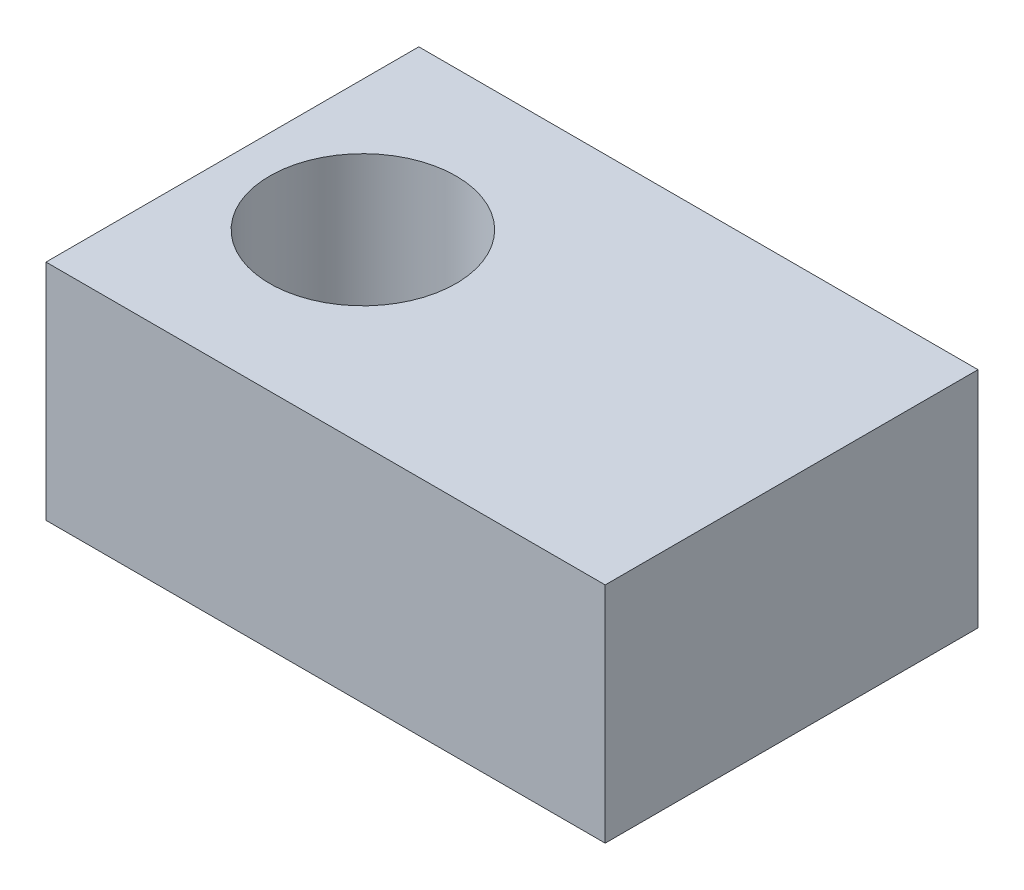
ISO-10303-21;
HEADER;
FILE_DESCRIPTION(('STEP AP214'),'2;1');
FILE_NAME('part.step','',(''),(''),'','','');
FILE_SCHEMA(('AUTOMOTIVE_DESIGN { 1 0 10303 214 1 1 1 1 }'));
ENDSEC;
DATA;
#1=APPLICATION_CONTEXT('core data for automotive mechanical design processes');
#2=APPLICATION_PROTOCOL_DEFINITION('international standard','automotive_design',2000,#1);
#3=PRODUCT_CONTEXT('',#1,'mechanical');
#4=PRODUCT('Part','Part','',(#3));
#5=PRODUCT_RELATED_PRODUCT_CATEGORY('part','',(#4));
#6=PRODUCT_DEFINITION_FORMATION('','',#4);
#7=PRODUCT_DEFINITION_CONTEXT('part definition',#1,'design');
#8=PRODUCT_DEFINITION('design','',#6,#7);
#9=PRODUCT_DEFINITION_SHAPE('','',#8);
#10=(LENGTH_UNIT() NAMED_UNIT(*) SI_UNIT(.MILLI.,.METRE.));
#11=(NAMED_UNIT(*) PLANE_ANGLE_UNIT() SI_UNIT($,.RADIAN.));
#12=(NAMED_UNIT(*) SI_UNIT($,.STERADIAN.) SOLID_ANGLE_UNIT());
#13=UNCERTAINTY_MEASURE_WITH_UNIT(LENGTH_MEASURE(1.E-05),#10,'distance_accuracy_value','');
#14=(GEOMETRIC_REPRESENTATION_CONTEXT(3) GLOBAL_UNCERTAINTY_ASSIGNED_CONTEXT((#13)) GLOBAL_UNIT_ASSIGNED_CONTEXT((#10,
#11,#12)) REPRESENTATION_CONTEXT('',''));
#15=CARTESIAN_POINT('',(0.,0.,0.));
#16=DIRECTION('',(0.,0.,1.));
#17=DIRECTION('',(1.,0.,0.));
#18=AXIS2_PLACEMENT_3D('',#15,#16,#17);
#19=CARTESIAN_POINT('',(0.,0.,0.));
#20=DIRECTION('',(0.,-1.,0.));
#21=DIRECTION('',(0.,0.,-1.));
#22=AXIS2_PLACEMENT_3D('',#19,#20,#21);
#23=PLANE('',#22);
#24=CARTESIAN_POINT('',(3.5,0.,-5.));
#25=DIRECTION('',(0.,-1.,0.));
#26=DIRECTION('',(0.,0.,-1.));
#27=AXIS2_PLACEMENT_3D('',#24,#25,#26);
#28=CIRCLE('',#27,2.5);
#29=CARTESIAN_POINT('',(3.5,0.,-7.5));
#30=VERTEX_POINT('',#29);
#31=EDGE_CURVE('E20',#30,#30,#28,.F.);
#32=ORIENTED_EDGE('',*,*,#31,.T.);
#33=EDGE_LOOP('',(#32));
#34=FACE_BOUND('',#33,.T.);
#35=DIRECTION('',(0.,0.,1.));
#36=VECTOR('',#35,1.);
#37=CARTESIAN_POINT('',(15.,0.,0.));
#38=LINE('',#37,#36);
#39=CARTESIAN_POINT('',(15.,0.,-10.));
#40=VERTEX_POINT('',#39);
#41=CARTESIAN_POINT('',(15.,0.,0.));
#42=VERTEX_POINT('',#41);
#43=EDGE_CURVE('E55',#40,#42,#38,.T.);
#44=ORIENTED_EDGE('',*,*,#43,.T.);
#45=DIRECTION('',(-1.,0.,0.));
#46=VECTOR('',#45,1.);
#47=CARTESIAN_POINT('',(0.,0.,0.));
#48=LINE('',#47,#46);
#49=CARTESIAN_POINT('',(0.,0.,0.));
#50=VERTEX_POINT('',#49);
#51=EDGE_CURVE('E79',#42,#50,#48,.T.);
#52=ORIENTED_EDGE('',*,*,#51,.T.);
#53=DIRECTION('',(0.,0.,-1.));
#54=VECTOR('',#53,1.);
#55=CARTESIAN_POINT('',(0.,0.,0.));
#56=LINE('',#55,#54);
#57=CARTESIAN_POINT('',(0.,0.,-10.));
#58=VERTEX_POINT('',#57);
#59=EDGE_CURVE('E59',#50,#58,#56,.T.);
#60=ORIENTED_EDGE('',*,*,#59,.T.);
#61=DIRECTION('',(1.,0.,0.));
#62=VECTOR('',#61,1.);
#63=CARTESIAN_POINT('',(0.,0.,-10.));
#64=LINE('',#63,#62);
#65=EDGE_CURVE('E58',#58,#40,#64,.T.);
#66=ORIENTED_EDGE('',*,*,#65,.T.);
#67=EDGE_LOOP('',(#44,#52,#60,#66));
#68=FACE_BOUND('',#67,.T.);
#69=ADVANCED_FACE('F17',(#34,#68),#23,.T.);
#70=CARTESIAN_POINT('',(0.,6.,-10.));
#71=DIRECTION('',(0.,0.,1.));
#72=DIRECTION('',(1.,0.,0.));
#73=AXIS2_PLACEMENT_3D('',#70,#71,#72);
#74=PLANE('',#73);
#75=DIRECTION('',(0.,1.,0.));
#76=VECTOR('',#75,1.);
#77=CARTESIAN_POINT('',(0.,6.,-10.));
#78=LINE('',#77,#76);
#79=CARTESIAN_POINT('',(0.,6.,-10.));
#80=VERTEX_POINT('',#79);
#81=EDGE_CURVE('E81',#58,#80,#78,.T.);
#82=ORIENTED_EDGE('',*,*,#81,.T.);
#83=DIRECTION('',(1.,0.,0.));
#84=VECTOR('',#83,1.);
#85=CARTESIAN_POINT('',(0.,6.,-10.));
#86=LINE('',#85,#84);
#87=CARTESIAN_POINT('',(15.,6.,-10.));
#88=VERTEX_POINT('',#87);
#89=EDGE_CURVE('E75',#80,#88,#86,.T.);
#90=ORIENTED_EDGE('',*,*,#89,.T.);
#91=DIRECTION('',(0.,1.,0.));
#92=VECTOR('',#91,1.);
#93=CARTESIAN_POINT('',(15.,6.,-10.));
#94=LINE('',#93,#92);
#95=EDGE_CURVE('E64',#88,#40,#94,.F.);
#96=ORIENTED_EDGE('',*,*,#95,.T.);
#97=ORIENTED_EDGE('',*,*,#65,.F.);
#98=EDGE_LOOP('',(#82,#90,#96,#97));
#99=FACE_BOUND('',#98,.T.);
#100=ADVANCED_FACE('F74',(#99),#74,.F.);
#101=CARTESIAN_POINT('',(15.,6.,0.));
#102=DIRECTION('',(-1.,0.,0.));
#103=DIRECTION('',(0.,0.,1.));
#104=AXIS2_PLACEMENT_3D('',#101,#102,#103);
#105=PLANE('',#104);
#106=ORIENTED_EDGE('',*,*,#95,.F.);
#107=DIRECTION('',(0.,0.,-1.));
#108=VECTOR('',#107,1.);
#109=CARTESIAN_POINT('',(15.,6.,0.));
#110=LINE('',#109,#108);
#111=CARTESIAN_POINT('',(15.,6.,0.));
#112=VERTEX_POINT('',#111);
#113=EDGE_CURVE('E86',#88,#112,#110,.F.);
#114=ORIENTED_EDGE('',*,*,#113,.T.);
#115=DIRECTION('',(0.,1.,0.));
#116=VECTOR('',#115,1.);
#117=CARTESIAN_POINT('',(15.,6.,0.));
#118=LINE('',#117,#116);
#119=EDGE_CURVE('E71',#112,#42,#118,.F.);
#120=ORIENTED_EDGE('',*,*,#119,.T.);
#121=ORIENTED_EDGE('',*,*,#43,.F.);
#122=EDGE_LOOP('',(#106,#114,#120,#121));
#123=FACE_BOUND('',#122,.T.);
#124=ADVANCED_FACE('F68',(#123),#105,.F.);
#125=CARTESIAN_POINT('',(0.,6.,0.));
#126=DIRECTION('',(0.,0.,-1.));
#127=DIRECTION('',(-1.,0.,0.));
#128=AXIS2_PLACEMENT_3D('',#125,#126,#127);
#129=PLANE('',#128);
#130=ORIENTED_EDGE('',*,*,#119,.F.);
#131=DIRECTION('',(1.,0.,0.));
#132=VECTOR('',#131,1.);
#133=CARTESIAN_POINT('',(0.,6.,0.));
#134=LINE('',#133,#132);
#135=CARTESIAN_POINT('',(0.,6.,0.));
#136=VERTEX_POINT('',#135);
#137=EDGE_CURVE('E88',#112,#136,#134,.F.);
#138=ORIENTED_EDGE('',*,*,#137,.T.);
#139=DIRECTION('',(0.,1.,0.));
#140=VECTOR('',#139,1.);
#141=CARTESIAN_POINT('',(0.,6.,0.));
#142=LINE('',#141,#140);
#143=EDGE_CURVE('E34',#136,#50,#142,.F.);
#144=ORIENTED_EDGE('',*,*,#143,.T.);
#145=ORIENTED_EDGE('',*,*,#51,.F.);
#146=EDGE_LOOP('',(#130,#138,#144,#145));
#147=FACE_BOUND('',#146,.T.);
#148=ADVANCED_FACE('F96',(#147),#129,.F.);
#149=CARTESIAN_POINT('',(0.,6.,0.));
#150=DIRECTION('',(1.,0.,0.));
#151=DIRECTION('',(0.,0.,-1.));
#152=AXIS2_PLACEMENT_3D('',#149,#150,#151);
#153=PLANE('',#152);
#154=ORIENTED_EDGE('',*,*,#143,.F.);
#155=DIRECTION('',(0.,0.,-1.));
#156=VECTOR('',#155,1.);
#157=CARTESIAN_POINT('',(0.,6.,0.));
#158=LINE('',#157,#156);
#159=EDGE_CURVE('E26',#136,#80,#158,.T.);
#160=ORIENTED_EDGE('',*,*,#159,.T.);
#161=ORIENTED_EDGE('',*,*,#81,.F.);
#162=ORIENTED_EDGE('',*,*,#59,.F.);
#163=EDGE_LOOP('',(#154,#160,#161,#162));
#164=FACE_BOUND('',#163,.T.);
#165=ADVANCED_FACE('F91',(#164),#153,.F.);
#166=CARTESIAN_POINT('',(3.5,6.,-5.));
#167=DIRECTION('',(0.,-1.,0.));
#168=DIRECTION('',(0.,0.,-1.));
#169=AXIS2_PLACEMENT_3D('',#166,#167,#168);
#170=CYLINDRICAL_SURFACE('',#169,2.5);
#171=ORIENTED_EDGE('',*,*,#31,.F.);
#172=EDGE_LOOP('',(#171));
#173=FACE_BOUND('',#172,.T.);
#174=CARTESIAN_POINT('',(3.5,6.,-5.));
#175=DIRECTION('',(0.,-1.,0.));
#176=DIRECTION('',(0.,0.,-1.));
#177=AXIS2_PLACEMENT_3D('',#174,#175,#176);
#178=CIRCLE('',#177,2.5);
#179=CARTESIAN_POINT('',(3.5,6.,-7.5));
#180=VERTEX_POINT('',#179);
#181=EDGE_CURVE('E11',#180,#180,#178,.F.);
#182=ORIENTED_EDGE('',*,*,#181,.T.);
#183=EDGE_LOOP('',(#182));
#184=FACE_BOUND('',#183,.T.);
#185=ADVANCED_FACE('F104',(#173,#184),#170,.F.);
#186=CARTESIAN_POINT('',(0.,6.,0.));
#187=DIRECTION('',(0.,-1.,0.));
#188=DIRECTION('',(0.,0.,-1.));
#189=AXIS2_PLACEMENT_3D('',#186,#187,#188);
#190=PLANE('',#189);
#191=ORIENTED_EDGE('',*,*,#181,.F.);
#192=EDGE_LOOP('',(#191));
#193=FACE_BOUND('',#192,.T.);
#194=ORIENTED_EDGE('',*,*,#137,.F.);
#195=ORIENTED_EDGE('',*,*,#113,.F.);
#196=ORIENTED_EDGE('',*,*,#89,.F.);
#197=ORIENTED_EDGE('',*,*,#159,.F.);
#198=EDGE_LOOP('',(#194,#195,#196,#197));
#199=FACE_BOUND('',#198,.T.);
#200=ADVANCED_FACE('F94',(#193,#199),#190,.F.);
#201=CLOSED_SHELL('',(#69,#100,#124,#148,#165,#185,#200));
#202=MANIFOLD_SOLID_BREP('B1',#201);
#203=ADVANCED_BREP_SHAPE_REPRESENTATION('',(#18,#202),#14);
#204=SHAPE_DEFINITION_REPRESENTATION(#9,#203);
ENDSEC;
END-ISO-10303-21;
